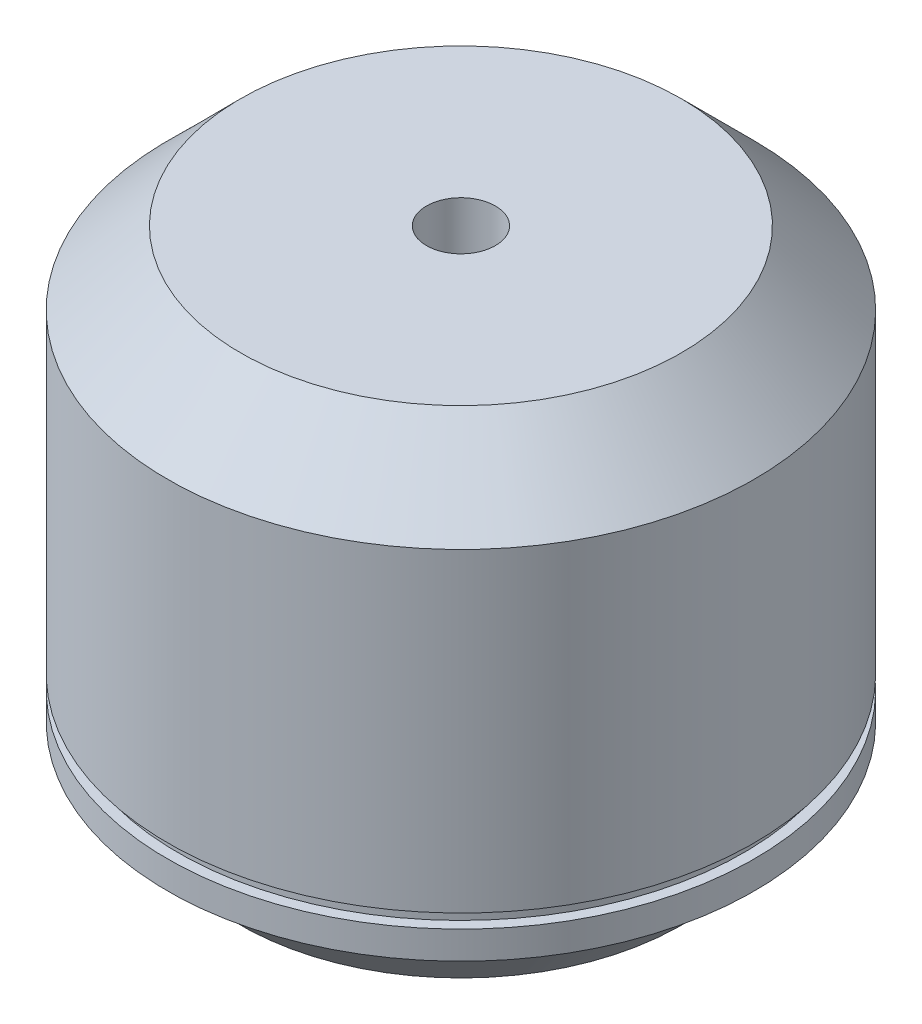
ISO-10303-21;
HEADER;
FILE_DESCRIPTION(('STEP AP214'),'2;1');
FILE_NAME('part.step','',(''),(''),'','','');
FILE_SCHEMA(('AUTOMOTIVE_DESIGN { 1 0 10303 214 1 1 1 1 }'));
ENDSEC;
DATA;
#1=APPLICATION_CONTEXT('core data for automotive mechanical design processes');
#2=APPLICATION_PROTOCOL_DEFINITION('international standard','automotive_design',2000,#1);
#3=PRODUCT_CONTEXT('',#1,'mechanical');
#4=PRODUCT('Part','Part','',(#3));
#5=PRODUCT_RELATED_PRODUCT_CATEGORY('part','',(#4));
#6=PRODUCT_DEFINITION_FORMATION('','',#4);
#7=PRODUCT_DEFINITION_CONTEXT('part definition',#1,'design');
#8=PRODUCT_DEFINITION('design','',#6,#7);
#9=PRODUCT_DEFINITION_SHAPE('','',#8);
#10=(LENGTH_UNIT() NAMED_UNIT(*) SI_UNIT(.MILLI.,.METRE.));
#11=(NAMED_UNIT(*) PLANE_ANGLE_UNIT() SI_UNIT($,.RADIAN.));
#12=(NAMED_UNIT(*) SI_UNIT($,.STERADIAN.) SOLID_ANGLE_UNIT());
#13=UNCERTAINTY_MEASURE_WITH_UNIT(LENGTH_MEASURE(1.E-05),#10,'distance_accuracy_value','');
#14=(GEOMETRIC_REPRESENTATION_CONTEXT(3) GLOBAL_UNCERTAINTY_ASSIGNED_CONTEXT((#13)) GLOBAL_UNIT_ASSIGNED_CONTEXT((#10,
#11,#12)) REPRESENTATION_CONTEXT('',''));
#15=CARTESIAN_POINT('',(0.,0.,0.));
#16=DIRECTION('',(0.,0.,1.));
#17=DIRECTION('',(1.,0.,0.));
#18=AXIS2_PLACEMENT_3D('',#15,#16,#17);
#19=CARTESIAN_POINT('',(16.,36.,0.));
#20=DIRECTION('',(0.,1.,0.));
#21=DIRECTION('',(0.,0.,1.));
#22=AXIS2_PLACEMENT_3D('',#19,#20,#21);
#23=PLANE('',#22);
#24=CARTESIAN_POINT('',(0.,36.,0.));
#25=DIRECTION('',(0.,-1.,0.));
#26=DIRECTION('',(0.,0.,-1.));
#27=AXIS2_PLACEMENT_3D('',#24,#25,#26);
#28=CIRCLE('',#27,2.5);
#29=CARTESIAN_POINT('',(0.,36.,-2.5));
#30=VERTEX_POINT('',#29);
#31=EDGE_CURVE('E10',#30,#30,#28,.T.);
#32=ORIENTED_EDGE('',*,*,#31,.T.);
#33=EDGE_LOOP('',(#32));
#34=FACE_BOUND('',#33,.T.);
#35=CARTESIAN_POINT('',(0.,36.,0.));
#36=DIRECTION('',(0.,-1.,0.));
#37=DIRECTION('',(0.,0.,-1.));
#38=AXIS2_PLACEMENT_3D('',#35,#36,#37);
#39=CIRCLE('',#38,16.);
#40=CARTESIAN_POINT('',(0.,36.,-16.));
#41=VERTEX_POINT('',#40);
#42=EDGE_CURVE('E74',#41,#41,#39,.T.);
#43=ORIENTED_EDGE('',*,*,#42,.F.);
#44=EDGE_LOOP('',(#43));
#45=FACE_BOUND('',#44,.T.);
#46=ADVANCED_FACE('F31',(#34,#45),#23,.T.);
#47=CARTESIAN_POINT('',(0.,0.,0.));
#48=DIRECTION('',(0.,-1.,0.));
#49=DIRECTION('',(0.,0.,-1.));
#50=AXIS2_PLACEMENT_3D('',#47,#48,#49);
#51=CYLINDRICAL_SURFACE('',#50,2.5);
#52=CARTESIAN_POINT('',(0.,1.,0.));
#53=DIRECTION('',(0.,-1.,0.));
#54=DIRECTION('',(0.,0.,-1.));
#55=AXIS2_PLACEMENT_3D('',#52,#53,#54);
#56=CIRCLE('',#55,2.5);
#57=CARTESIAN_POINT('',(0.,1.,-2.5));
#58=VERTEX_POINT('',#57);
#59=EDGE_CURVE('E37',#58,#58,#56,.T.);
#60=ORIENTED_EDGE('',*,*,#59,.T.);
#61=EDGE_LOOP('',(#60));
#62=FACE_BOUND('',#61,.T.);
#63=ORIENTED_EDGE('',*,*,#31,.F.);
#64=EDGE_LOOP('',(#63));
#65=FACE_BOUND('',#64,.T.);
#66=ADVANCED_FACE('F132',(#62,#65),#51,.F.);
#67=CARTESIAN_POINT('',(2.5,1.,0.));
#68=DIRECTION('',(0.,-1.,0.));
#69=DIRECTION('',(0.,0.,-1.));
#70=AXIS2_PLACEMENT_3D('',#67,#68,#69);
#71=PLANE('',#70);
#72=CARTESIAN_POINT('',(0.,1.,0.));
#73=DIRECTION('',(0.,-1.,0.));
#74=DIRECTION('',(0.,0.,-1.));
#75=AXIS2_PLACEMENT_3D('',#72,#73,#74);
#76=CIRCLE('',#75,8.);
#77=CARTESIAN_POINT('',(0.,1.,-8.));
#78=VERTEX_POINT('',#77);
#79=EDGE_CURVE('E41',#78,#78,#76,.T.);
#80=ORIENTED_EDGE('',*,*,#79,.T.);
#81=EDGE_LOOP('',(#80));
#82=FACE_BOUND('',#81,.T.);
#83=ORIENTED_EDGE('',*,*,#59,.F.);
#84=EDGE_LOOP('',(#83));
#85=FACE_BOUND('',#84,.T.);
#86=ADVANCED_FACE('F126',(#82,#85),#71,.T.);
#87=CARTESIAN_POINT('',(0.,0.,0.));
#88=DIRECTION('',(0.,-1.,0.));
#89=DIRECTION('',(0.,0.,-1.));
#90=AXIS2_PLACEMENT_3D('',#87,#88,#89);
#91=CYLINDRICAL_SURFACE('',#90,8.);
#92=CARTESIAN_POINT('',(0.,0.,0.));
#93=DIRECTION('',(0.,-1.,0.));
#94=DIRECTION('',(0.,0.,-1.));
#95=AXIS2_PLACEMENT_3D('',#92,#93,#94);
#96=CIRCLE('',#95,8.);
#97=CARTESIAN_POINT('',(0.,0.,-8.));
#98=VERTEX_POINT('',#97);
#99=EDGE_CURVE('E45',#98,#98,#96,.T.);
#100=ORIENTED_EDGE('',*,*,#99,.T.);
#101=EDGE_LOOP('',(#100));
#102=FACE_BOUND('',#101,.T.);
#103=ORIENTED_EDGE('',*,*,#79,.F.);
#104=EDGE_LOOP('',(#103));
#105=FACE_BOUND('',#104,.T.);
#106=ADVANCED_FACE('F115',(#102,#105),#91,.F.);
#107=CARTESIAN_POINT('',(8.,0.,0.));
#108=DIRECTION('',(0.,-1.,0.));
#109=DIRECTION('',(0.,0.,-1.));
#110=AXIS2_PLACEMENT_3D('',#107,#108,#109);
#111=PLANE('',#110);
#112=CARTESIAN_POINT('',(-8.83883476483184,0.,-8.83883476483185));
#113=DIRECTION('',(0.,-1.,0.));
#114=DIRECTION('',(0.,0.,-1.));
#115=AXIS2_PLACEMENT_3D('',#112,#113,#114);
#116=CIRCLE('',#115,1.5);
#117=CARTESIAN_POINT('',(-8.83883476483184,0.,-10.3388347648318));
#118=VERTEX_POINT('',#117);
#119=EDGE_CURVE('E84',#118,#118,#116,.T.);
#120=ORIENTED_EDGE('',*,*,#119,.F.);
#121=EDGE_LOOP('',(#120));
#122=FACE_BOUND('',#121,.T.);
#123=CARTESIAN_POINT('',(8.83883476483185,0.,-8.83883476483185));
#124=DIRECTION('',(0.,-1.,0.));
#125=DIRECTION('',(0.,0.,-1.));
#126=AXIS2_PLACEMENT_3D('',#123,#124,#125);
#127=CIRCLE('',#126,1.5);
#128=CARTESIAN_POINT('',(8.83883476483185,0.,-10.3388347648318));
#129=VERTEX_POINT('',#128);
#130=EDGE_CURVE('E90',#129,#129,#127,.T.);
#131=ORIENTED_EDGE('',*,*,#130,.F.);
#132=EDGE_LOOP('',(#131));
#133=FACE_BOUND('',#132,.T.);
#134=CARTESIAN_POINT('',(8.83883476483185,0.,8.83883476483184));
#135=DIRECTION('',(0.,-1.,0.));
#136=DIRECTION('',(0.,0.,-1.));
#137=AXIS2_PLACEMENT_3D('',#134,#135,#136);
#138=CIRCLE('',#137,1.5);
#139=CARTESIAN_POINT('',(8.83883476483185,0.,7.33883476483184));
#140=VERTEX_POINT('',#139);
#141=EDGE_CURVE('E96',#140,#140,#138,.T.);
#142=ORIENTED_EDGE('',*,*,#141,.F.);
#143=EDGE_LOOP('',(#142));
#144=FACE_BOUND('',#143,.T.);
#145=CARTESIAN_POINT('',(-8.83883476483184,0.,8.83883476483184));
#146=DIRECTION('',(0.,-1.,0.));
#147=DIRECTION('',(0.,0.,-1.));
#148=AXIS2_PLACEMENT_3D('',#145,#146,#147);
#149=CIRCLE('',#148,1.5);
#150=CARTESIAN_POINT('',(-8.83883476483184,0.,7.33883476483184));
#151=VERTEX_POINT('',#150);
#152=EDGE_CURVE('E78',#151,#151,#149,.T.);
#153=ORIENTED_EDGE('',*,*,#152,.F.);
#154=EDGE_LOOP('',(#153));
#155=FACE_BOUND('',#154,.T.);
#156=CARTESIAN_POINT('',(0.,0.,0.));
#157=DIRECTION('',(0.,-1.,0.));
#158=DIRECTION('',(0.,0.,-1.));
#159=AXIS2_PLACEMENT_3D('',#156,#157,#158);
#160=CIRCLE('',#159,16.);
#161=CARTESIAN_POINT('',(0.,0.,-16.));
#162=VERTEX_POINT('',#161);
#163=EDGE_CURVE('E50',#162,#162,#160,.T.);
#164=ORIENTED_EDGE('',*,*,#163,.T.);
#165=EDGE_LOOP('',(#164));
#166=FACE_BOUND('',#165,.T.);
#167=ORIENTED_EDGE('',*,*,#99,.F.);
#168=EDGE_LOOP('',(#167));
#169=FACE_BOUND('',#168,.T.);
#170=ADVANCED_FACE('F111',(#122,#133,#144,#155,#166,#169),#111,.T.);
#171=CARTESIAN_POINT('',(0.,0.,0.));
#172=DIRECTION('',(0.,1.,0.));
#173=DIRECTION('',(0.,0.,1.));
#174=AXIS2_PLACEMENT_3D('',#171,#172,#173);
#175=CONICAL_SURFACE('',#174,16.,0.785398163397447);
#176=CARTESIAN_POINT('',(0.,4.80000000000002,0.));
#177=DIRECTION('',(0.,-1.,0.));
#178=DIRECTION('',(0.,0.,-1.));
#179=AXIS2_PLACEMENT_3D('',#176,#177,#178);
#180=CIRCLE('',#179,20.8);
#181=CARTESIAN_POINT('',(0.,4.80000000000002,-20.8));
#182=VERTEX_POINT('',#181);
#183=EDGE_CURVE('E53',#182,#182,#180,.T.);
#184=ORIENTED_EDGE('',*,*,#183,.T.);
#185=EDGE_LOOP('',(#184));
#186=FACE_BOUND('',#185,.T.);
#187=ORIENTED_EDGE('',*,*,#163,.F.);
#188=EDGE_LOOP('',(#187));
#189=FACE_BOUND('',#188,.T.);
#190=ADVANCED_FACE('F114',(#186,#189),#175,.T.);
#191=CARTESIAN_POINT('',(20.8,4.80000000000002,0.));
#192=DIRECTION('',(0.,-1.,0.));
#193=DIRECTION('',(0.,0.,-1.));
#194=AXIS2_PLACEMENT_3D('',#191,#192,#193);
#195=PLANE('',#194);
#196=CARTESIAN_POINT('',(0.,4.80000000000002,0.));
#197=DIRECTION('',(0.,-1.,0.));
#198=DIRECTION('',(0.,0.,-1.));
#199=AXIS2_PLACEMENT_3D('',#196,#197,#198);
#200=CIRCLE('',#199,21.3);
#201=CARTESIAN_POINT('',(0.,4.80000000000002,-21.3));
#202=VERTEX_POINT('',#201);
#203=EDGE_CURVE('E56',#202,#202,#200,.T.);
#204=ORIENTED_EDGE('',*,*,#203,.T.);
#205=EDGE_LOOP('',(#204));
#206=FACE_BOUND('',#205,.T.);
#207=ORIENTED_EDGE('',*,*,#183,.F.);
#208=EDGE_LOOP('',(#207));
#209=FACE_BOUND('',#208,.T.);
#210=ADVANCED_FACE('F177',(#206,#209),#195,.T.);
#211=CARTESIAN_POINT('',(0.,0.,0.));
#212=DIRECTION('',(0.,-1.,0.));
#213=DIRECTION('',(0.,0.,-1.));
#214=AXIS2_PLACEMENT_3D('',#211,#212,#213);
#215=CYLINDRICAL_SURFACE('',#214,21.3);
#216=CARTESIAN_POINT('',(0.,6.82198055066473,0.));
#217=DIRECTION('',(0.,-1.,0.));
#218=DIRECTION('',(0.,0.,-1.));
#219=AXIS2_PLACEMENT_3D('',#216,#217,#218);
#220=CIRCLE('',#219,21.3);
#221=CARTESIAN_POINT('',(0.,6.82198055066473,-21.3));
#222=VERTEX_POINT('',#221);
#223=EDGE_CURVE('E59',#222,#222,#220,.T.);
#224=ORIENTED_EDGE('',*,*,#223,.T.);
#225=EDGE_LOOP('',(#224));
#226=FACE_BOUND('',#225,.T.);
#227=ORIENTED_EDGE('',*,*,#203,.F.);
#228=EDGE_LOOP('',(#227));
#229=FACE_BOUND('',#228,.T.);
#230=ADVANCED_FACE('F171',(#226,#229),#215,.T.);
#231=CARTESIAN_POINT('',(21.3,6.82198055066473,0.));
#232=DIRECTION('',(0.,1.,0.));
#233=DIRECTION('',(0.,0.,1.));
#234=AXIS2_PLACEMENT_3D('',#231,#232,#233);
#235=PLANE('',#234);
#236=CARTESIAN_POINT('',(0.,6.82198055066473,0.));
#237=DIRECTION('',(0.,-1.,0.));
#238=DIRECTION('',(0.,0.,-1.));
#239=AXIS2_PLACEMENT_3D('',#236,#237,#238);
#240=CIRCLE('',#239,20.529759761911);
#241=CARTESIAN_POINT('',(0.,6.82198055066473,-20.529759761911));
#242=VERTEX_POINT('',#241);
#243=EDGE_CURVE('E62',#242,#242,#240,.T.);
#244=ORIENTED_EDGE('',*,*,#243,.T.);
#245=EDGE_LOOP('',(#244));
#246=FACE_BOUND('',#245,.T.);
#247=ORIENTED_EDGE('',*,*,#223,.F.);
#248=EDGE_LOOP('',(#247));
#249=FACE_BOUND('',#248,.T.);
#250=ADVANCED_FACE('F165',(#246,#249),#235,.T.);
#251=CARTESIAN_POINT('',(0.,0.,0.));
#252=DIRECTION('',(0.,-1.,0.));
#253=DIRECTION('',(0.,0.,-1.));
#254=AXIS2_PLACEMENT_3D('',#251,#252,#253);
#255=CYLINDRICAL_SURFACE('',#254,20.529759761911);
#256=CARTESIAN_POINT('',(0.,7.83094919267474,0.));
#257=DIRECTION('',(0.,-1.,0.));
#258=DIRECTION('',(0.,0.,-1.));
#259=AXIS2_PLACEMENT_3D('',#256,#257,#258);
#260=CIRCLE('',#259,20.529759761911);
#261=CARTESIAN_POINT('',(0.,7.83094919267474,-20.529759761911));
#262=VERTEX_POINT('',#261);
#263=EDGE_CURVE('E65',#262,#262,#260,.T.);
#264=ORIENTED_EDGE('',*,*,#263,.T.);
#265=EDGE_LOOP('',(#264));
#266=FACE_BOUND('',#265,.T.);
#267=ORIENTED_EDGE('',*,*,#243,.F.);
#268=EDGE_LOOP('',(#267));
#269=FACE_BOUND('',#268,.T.);
#270=ADVANCED_FACE('F159',(#266,#269),#255,.T.);
#271=CARTESIAN_POINT('',(21.3,7.83094919267474,0.));
#272=DIRECTION('',(0.,-1.,0.));
#273=DIRECTION('',(0.,0.,-1.));
#274=AXIS2_PLACEMENT_3D('',#271,#272,#273);
#275=PLANE('',#274);
#276=CARTESIAN_POINT('',(0.,7.83094919267474,0.));
#277=DIRECTION('',(0.,-1.,0.));
#278=DIRECTION('',(0.,0.,-1.));
#279=AXIS2_PLACEMENT_3D('',#276,#277,#278);
#280=CIRCLE('',#279,21.3);
#281=CARTESIAN_POINT('',(0.,7.83094919267474,-21.3));
#282=VERTEX_POINT('',#281);
#283=EDGE_CURVE('E68',#282,#282,#280,.T.);
#284=ORIENTED_EDGE('',*,*,#283,.T.);
#285=EDGE_LOOP('',(#284));
#286=FACE_BOUND('',#285,.T.);
#287=ORIENTED_EDGE('',*,*,#263,.F.);
#288=EDGE_LOOP('',(#287));
#289=FACE_BOUND('',#288,.T.);
#290=ADVANCED_FACE('F153',(#286,#289),#275,.T.);
#291=CARTESIAN_POINT('',(0.,0.,0.));
#292=DIRECTION('',(0.,-1.,0.));
#293=DIRECTION('',(0.,0.,-1.));
#294=AXIS2_PLACEMENT_3D('',#291,#292,#293);
#295=CYLINDRICAL_SURFACE('',#294,21.3);
#296=CARTESIAN_POINT('',(0.,30.7,0.));
#297=DIRECTION('',(0.,-1.,0.));
#298=DIRECTION('',(0.,0.,-1.));
#299=AXIS2_PLACEMENT_3D('',#296,#297,#298);
#300=CIRCLE('',#299,21.3);
#301=CARTESIAN_POINT('',(0.,30.7,-21.3));
#302=VERTEX_POINT('',#301);
#303=EDGE_CURVE('E71',#302,#302,#300,.T.);
#304=ORIENTED_EDGE('',*,*,#303,.T.);
#305=EDGE_LOOP('',(#304));
#306=FACE_BOUND('',#305,.T.);
#307=ORIENTED_EDGE('',*,*,#283,.F.);
#308=EDGE_LOOP('',(#307));
#309=FACE_BOUND('',#308,.T.);
#310=ADVANCED_FACE('F147',(#306,#309),#295,.T.);
#311=CARTESIAN_POINT('',(0.,30.7,0.));
#312=DIRECTION('',(0.,-1.,0.));
#313=DIRECTION('',(0.,0.,-1.));
#314=AXIS2_PLACEMENT_3D('',#311,#312,#313);
#315=CONICAL_SURFACE('',#314,21.3,0.785398163397451);
#316=ORIENTED_EDGE('',*,*,#42,.T.);
#317=EDGE_LOOP('',(#316));
#318=FACE_BOUND('',#317,.T.);
#319=ORIENTED_EDGE('',*,*,#303,.F.);
#320=EDGE_LOOP('',(#319));
#321=FACE_BOUND('',#320,.T.);
#322=ADVANCED_FACE('F143',(#318,#321),#315,.T.);
#323=CARTESIAN_POINT('',(-8.83883476483184,5.,8.83883476483184));
#324=DIRECTION('',(0.,-1.,0.));
#325=DIRECTION('',(0.,0.,-1.));
#326=AXIS2_PLACEMENT_3D('',#323,#324,#325);
#327=CYLINDRICAL_SURFACE('',#326,1.5);
#328=CARTESIAN_POINT('',(-8.83883476483184,5.,8.83883476483184));
#329=DIRECTION('',(0.,-1.,0.));
#330=DIRECTION('',(0.,0.,-1.));
#331=AXIS2_PLACEMENT_3D('',#328,#329,#330);
#332=CIRCLE('',#331,1.5);
#333=CARTESIAN_POINT('',(-8.83883476483184,5.,7.33883476483184));
#334=VERTEX_POINT('',#333);
#335=EDGE_CURVE('E77',#334,#334,#332,.T.);
#336=ORIENTED_EDGE('',*,*,#335,.F.);
#337=EDGE_LOOP('',(#336));
#338=FACE_BOUND('',#337,.T.);
#339=ORIENTED_EDGE('',*,*,#152,.T.);
#340=EDGE_LOOP('',(#339));
#341=FACE_BOUND('',#340,.T.);
#342=ADVANCED_FACE('F146',(#338,#341),#327,.F.);
#343=CARTESIAN_POINT('',(-8.83883476483184,5.,8.83883476483184));
#344=DIRECTION('',(0.,-1.,0.));
#345=DIRECTION('',(0.,0.,-1.));
#346=AXIS2_PLACEMENT_3D('',#343,#344,#345);
#347=PLANE('',#346);
#348=ORIENTED_EDGE('',*,*,#335,.T.);
#349=EDGE_LOOP('',(#348));
#350=FACE_BOUND('',#349,.T.);
#351=ADVANCED_FACE('F107',(#350),#347,.T.);
#352=CARTESIAN_POINT('',(8.83883476483185,5.,8.83883476483184));
#353=DIRECTION('',(0.,-1.,0.));
#354=DIRECTION('',(0.,0.,-1.));
#355=AXIS2_PLACEMENT_3D('',#352,#353,#354);
#356=CYLINDRICAL_SURFACE('',#355,1.5);
#357=CARTESIAN_POINT('',(8.83883476483185,5.,8.83883476483184));
#358=DIRECTION('',(0.,-1.,0.));
#359=DIRECTION('',(0.,0.,-1.));
#360=AXIS2_PLACEMENT_3D('',#357,#358,#359);
#361=CIRCLE('',#360,1.5);
#362=CARTESIAN_POINT('',(8.83883476483185,5.,7.33883476483184));
#363=VERTEX_POINT('',#362);
#364=EDGE_CURVE('E81',#363,#363,#361,.T.);
#365=ORIENTED_EDGE('',*,*,#364,.F.);
#366=EDGE_LOOP('',(#365));
#367=FACE_BOUND('',#366,.T.);
#368=ORIENTED_EDGE('',*,*,#141,.T.);
#369=EDGE_LOOP('',(#368));
#370=FACE_BOUND('',#369,.T.);
#371=ADVANCED_FACE('F104',(#367,#370),#356,.F.);
#372=CARTESIAN_POINT('',(8.83883476483185,5.,8.83883476483184));
#373=DIRECTION('',(0.,-1.,0.));
#374=DIRECTION('',(0.,0.,-1.));
#375=AXIS2_PLACEMENT_3D('',#372,#373,#374);
#376=PLANE('',#375);
#377=ORIENTED_EDGE('',*,*,#364,.T.);
#378=EDGE_LOOP('',(#377));
#379=FACE_BOUND('',#378,.T.);
#380=ADVANCED_FACE('F102',(#379),#376,.T.);
#381=CARTESIAN_POINT('',(8.83883476483185,5.,-8.83883476483185));
#382=DIRECTION('',(0.,-1.,0.));
#383=DIRECTION('',(0.,0.,-1.));
#384=AXIS2_PLACEMENT_3D('',#381,#382,#383);
#385=CYLINDRICAL_SURFACE('',#384,1.5);
#386=CARTESIAN_POINT('',(8.83883476483185,5.,-8.83883476483185));
#387=DIRECTION('',(0.,-1.,0.));
#388=DIRECTION('',(0.,0.,-1.));
#389=AXIS2_PLACEMENT_3D('',#386,#387,#388);
#390=CIRCLE('',#389,1.5);
#391=CARTESIAN_POINT('',(8.83883476483185,5.,-10.3388347648318));
#392=VERTEX_POINT('',#391);
#393=EDGE_CURVE('E93',#392,#392,#390,.T.);
#394=ORIENTED_EDGE('',*,*,#393,.F.);
#395=EDGE_LOOP('',(#394));
#396=FACE_BOUND('',#395,.T.);
#397=ORIENTED_EDGE('',*,*,#130,.T.);
#398=EDGE_LOOP('',(#397));
#399=FACE_BOUND('',#398,.T.);
#400=ADVANCED_FACE('F207',(#396,#399),#385,.F.);
#401=CARTESIAN_POINT('',(8.83883476483185,5.,-8.83883476483185));
#402=DIRECTION('',(0.,-1.,0.));
#403=DIRECTION('',(0.,0.,-1.));
#404=AXIS2_PLACEMENT_3D('',#401,#402,#403);
#405=PLANE('',#404);
#406=ORIENTED_EDGE('',*,*,#393,.T.);
#407=EDGE_LOOP('',(#406));
#408=FACE_BOUND('',#407,.T.);
#409=ADVANCED_FACE('F202',(#408),#405,.T.);
#410=CARTESIAN_POINT('',(-8.83883476483184,5.,-8.83883476483185));
#411=DIRECTION('',(0.,-1.,0.));
#412=DIRECTION('',(0.,0.,-1.));
#413=AXIS2_PLACEMENT_3D('',#410,#411,#412);
#414=CYLINDRICAL_SURFACE('',#413,1.5);
#415=CARTESIAN_POINT('',(-8.83883476483184,5.,-8.83883476483185));
#416=DIRECTION('',(0.,-1.,0.));
#417=DIRECTION('',(0.,0.,-1.));
#418=AXIS2_PLACEMENT_3D('',#415,#416,#417);
#419=CIRCLE('',#418,1.5);
#420=CARTESIAN_POINT('',(-8.83883476483184,5.,-10.3388347648318));
#421=VERTEX_POINT('',#420);
#422=EDGE_CURVE('E87',#421,#421,#419,.T.);
#423=ORIENTED_EDGE('',*,*,#422,.F.);
#424=EDGE_LOOP('',(#423));
#425=FACE_BOUND('',#424,.T.);
#426=ORIENTED_EDGE('',*,*,#119,.T.);
#427=EDGE_LOOP('',(#426));
#428=FACE_BOUND('',#427,.T.);
#429=ADVANCED_FACE('F198',(#425,#428),#414,.F.);
#430=CARTESIAN_POINT('',(-8.83883476483184,5.,-8.83883476483185));
#431=DIRECTION('',(0.,-1.,0.));
#432=DIRECTION('',(0.,0.,-1.));
#433=AXIS2_PLACEMENT_3D('',#430,#431,#432);
#434=PLANE('',#433);
#435=ORIENTED_EDGE('',*,*,#422,.T.);
#436=EDGE_LOOP('',(#435));
#437=FACE_BOUND('',#436,.T.);
#438=ADVANCED_FACE('F201',(#437),#434,.T.);
#439=CLOSED_SHELL('',(#46,#66,#86,#106,#170,#190,#210,#230,#250,#270,#290,#310,#322,#342,#351,
#371,#380,#400,#409,#429,#438));
#440=MANIFOLD_SOLID_BREP('B2',#439);
#441=ADVANCED_BREP_SHAPE_REPRESENTATION('',(#18,#440),#14);
#442=SHAPE_DEFINITION_REPRESENTATION(#9,#441);
ENDSEC;
END-ISO-10303-21;
